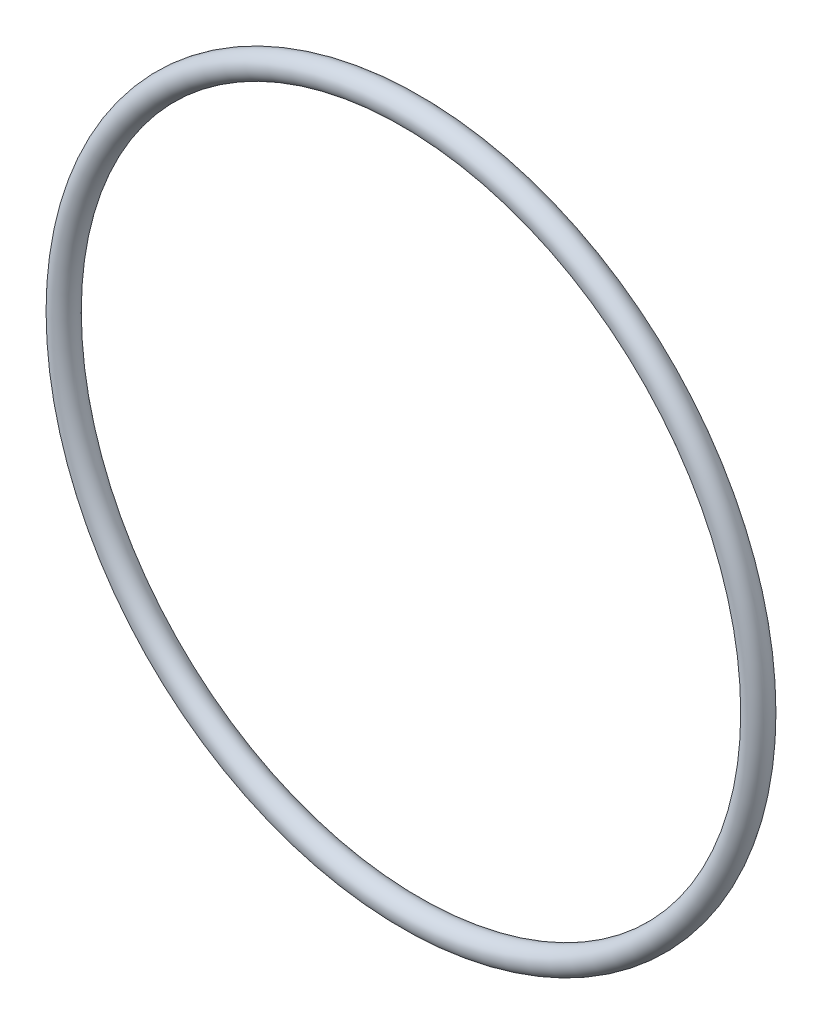
ISO-10303-21;
HEADER;
FILE_DESCRIPTION(('STEP AP214'),'2;1');
FILE_NAME('part.step','',(''),(''),'','','');
FILE_SCHEMA(('AUTOMOTIVE_DESIGN { 1 0 10303 214 1 1 1 1 }'));
ENDSEC;
DATA;
#1=APPLICATION_CONTEXT('core data for automotive mechanical design processes');
#2=APPLICATION_PROTOCOL_DEFINITION('international standard','automotive_design',2000,#1);
#3=PRODUCT_CONTEXT('',#1,'mechanical');
#4=PRODUCT('Part','Part','',(#3));
#5=PRODUCT_RELATED_PRODUCT_CATEGORY('part','',(#4));
#6=PRODUCT_DEFINITION_FORMATION('','',#4);
#7=PRODUCT_DEFINITION_CONTEXT('part definition',#1,'design');
#8=PRODUCT_DEFINITION('design','',#6,#7);
#9=PRODUCT_DEFINITION_SHAPE('','',#8);
#10=(LENGTH_UNIT() NAMED_UNIT(*) SI_UNIT(.MILLI.,.METRE.));
#11=(NAMED_UNIT(*) PLANE_ANGLE_UNIT() SI_UNIT($,.RADIAN.));
#12=(NAMED_UNIT(*) SI_UNIT($,.STERADIAN.) SOLID_ANGLE_UNIT());
#13=UNCERTAINTY_MEASURE_WITH_UNIT(LENGTH_MEASURE(1.E-05),#10,'distance_accuracy_value','');
#14=(GEOMETRIC_REPRESENTATION_CONTEXT(3) GLOBAL_UNCERTAINTY_ASSIGNED_CONTEXT((#13)) GLOBAL_UNIT_ASSIGNED_CONTEXT((#10,
#11,#12)) REPRESENTATION_CONTEXT('',''));
#15=CARTESIAN_POINT('',(0.,0.,0.));
#16=DIRECTION('',(0.,0.,1.));
#17=DIRECTION('',(1.,0.,0.));
#18=AXIS2_PLACEMENT_3D('',#15,#16,#17);
#19=CARTESIAN_POINT('',(0.,0.,0.));
#20=DIRECTION('',(0.,0.,1.));
#21=DIRECTION('',(1.,0.,0.));
#22=AXIS2_PLACEMENT_3D('',#19,#20,#21);
#23=TOROIDAL_SURFACE('',#22,49.1871,1.7653);
#24=CARTESIAN_POINT('',(50.9524,0.,0.));
#25=VERTEX_POINT('',#24);
#26=VERTEX_LOOP('',#25);
#27=FACE_BOUND('',#26,.T.);
#28=ADVANCED_FACE('F30',(#27),#23,.T.);
#29=CLOSED_SHELL('',(#28));
#30=MANIFOLD_SOLID_BREP('B2',#29);
#31=ADVANCED_BREP_SHAPE_REPRESENTATION('',(#18,#30),#14);
#32=SHAPE_DEFINITION_REPRESENTATION(#9,#31);
ENDSEC;
END-ISO-10303-21;
